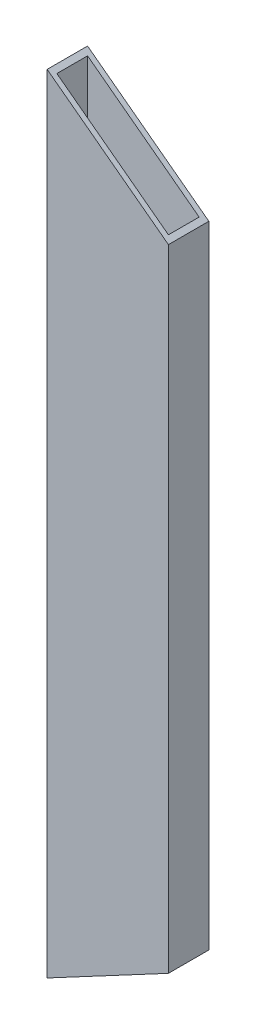
ISO-10303-21;
HEADER;
FILE_DESCRIPTION(('STEP AP214'),'2;1');
FILE_NAME('part.step','',(''),(''),'','','');
FILE_SCHEMA(('AUTOMOTIVE_DESIGN { 1 0 10303 214 1 1 1 1 }'));
ENDSEC;
DATA;
#1=APPLICATION_CONTEXT('core data for automotive mechanical design processes');
#2=APPLICATION_PROTOCOL_DEFINITION('international standard','automotive_design',2000,#1);
#3=PRODUCT_CONTEXT('',#1,'mechanical');
#4=PRODUCT('Part','Part','',(#3));
#5=PRODUCT_RELATED_PRODUCT_CATEGORY('part','',(#4));
#6=PRODUCT_DEFINITION_FORMATION('','',#4);
#7=PRODUCT_DEFINITION_CONTEXT('part definition',#1,'design');
#8=PRODUCT_DEFINITION('design','',#6,#7);
#9=PRODUCT_DEFINITION_SHAPE('','',#8);
#10=(LENGTH_UNIT() NAMED_UNIT(*) SI_UNIT(.MILLI.,.METRE.));
#11=(NAMED_UNIT(*) PLANE_ANGLE_UNIT() SI_UNIT($,.RADIAN.));
#12=(NAMED_UNIT(*) SI_UNIT($,.STERADIAN.) SOLID_ANGLE_UNIT());
#13=UNCERTAINTY_MEASURE_WITH_UNIT(LENGTH_MEASURE(1.E-05),#10,'distance_accuracy_value','');
#14=(GEOMETRIC_REPRESENTATION_CONTEXT(3) GLOBAL_UNCERTAINTY_ASSIGNED_CONTEXT((#13)) GLOBAL_UNIT_ASSIGNED_CONTEXT((#10,
#11,#12)) REPRESENTATION_CONTEXT('',''));
#15=CARTESIAN_POINT('',(0.,0.,0.));
#16=DIRECTION('',(0.,0.,1.));
#17=DIRECTION('',(1.,0.,0.));
#18=AXIS2_PLACEMENT_3D('',#15,#16,#17);
#19=CARTESIAN_POINT('',(-38.1,536.341159245056,-12.7));
#20=DIRECTION('',(1.,0.,0.));
#21=DIRECTION('',(0.,0.,-1.));
#22=AXIS2_PLACEMENT_3D('',#19,#20,#21);
#23=PLANE('',#22);
#24=DIRECTION('',(0.,-1.,0.));
#25=VECTOR('',#24,1.);
#26=CARTESIAN_POINT('',(-38.1,536.341159245056,-12.7));
#27=LINE('',#26,#25);
#28=CARTESIAN_POINT('',(-38.0999999999999,517.316735070927,-12.7));
#29=VERTEX_POINT('',#28);
#30=CARTESIAN_POINT('',(-38.1,22.8617814721547,-12.7));
#31=VERTEX_POINT('',#30);
#32=EDGE_CURVE('E113',#29,#31,#27,.T.);
#33=ORIENTED_EDGE('',*,*,#32,.T.);
#34=DIRECTION('',(0.,0.,1.));
#35=VECTOR('',#34,1.);
#36=CARTESIAN_POINT('',(-38.1,22.8617814721547,-12.6999999999999));
#37=LINE('',#36,#35);
#38=CARTESIAN_POINT('',(-38.1,22.8617814721547,12.7));
#39=VERTEX_POINT('',#38);
#40=EDGE_CURVE('E50',#31,#39,#37,.T.);
#41=ORIENTED_EDGE('',*,*,#40,.T.);
#42=DIRECTION('',(0.,-1.,0.));
#43=VECTOR('',#42,1.);
#44=CARTESIAN_POINT('',(-38.1,536.341159245056,12.7));
#45=LINE('',#44,#43);
#46=CARTESIAN_POINT('',(-38.0999999999999,517.316735070927,12.7));
#47=VERTEX_POINT('',#46);
#48=EDGE_CURVE('E111',#47,#39,#45,.T.);
#49=ORIENTED_EDGE('',*,*,#48,.F.);
#50=DIRECTION('',(0.,0.,-1.));
#51=VECTOR('',#50,1.);
#52=CARTESIAN_POINT('',(-38.1,517.316735070927,-12.7));
#53=LINE('',#52,#51);
#54=EDGE_CURVE('E138',#47,#29,#53,.T.);
#55=ORIENTED_EDGE('',*,*,#54,.T.);
#56=EDGE_LOOP('',(#33,#41,#49,#55));
#57=FACE_BOUND('',#56,.T.);
#58=ADVANCED_FACE('F36',(#57),#23,.F.);
#59=CARTESIAN_POINT('',(-38.1,536.341159245056,12.7));
#60=DIRECTION('',(0.,0.,-1.));
#61=DIRECTION('',(-1.,0.,0.));
#62=AXIS2_PLACEMENT_3D('',#59,#60,#61);
#63=PLANE('',#62);
#64=ORIENTED_EDGE('',*,*,#48,.T.);
#65=DIRECTION('',(0.882385296761728,0.470527563548318,0.));
#66=VECTOR('',#65,1.);
#67=CARTESIAN_POINT('',(-87.3188564866453,-3.383928546231,12.7));
#68=LINE('',#67,#66);
#69=CARTESIAN_POINT('',(38.1,63.4950518518442,12.7));
#70=VERTEX_POINT('',#69);
#71=EDGE_CURVE('E97',#39,#70,#68,.T.);
#72=ORIENTED_EDGE('',*,*,#71,.T.);
#73=DIRECTION('',(0.,-1.,0.));
#74=VECTOR('',#73,1.);
#75=CARTESIAN_POINT('',(38.1,536.341159245056,12.7));
#76=LINE('',#75,#74);
#77=CARTESIAN_POINT('',(38.1,460.038718408292,12.7));
#78=VERTEX_POINT('',#77);
#79=EDGE_CURVE('E118',#78,#70,#76,.T.);
#80=ORIENTED_EDGE('',*,*,#79,.F.);
#81=DIRECTION('',(0.799354935162214,-0.600859124613925,0.));
#82=VECTOR('',#81,1.);
#83=CARTESIAN_POINT('',(-147.887614777533,599.841890301616,12.7));
#84=LINE('',#83,#82);
#85=EDGE_CURVE('E114',#47,#78,#84,.T.);
#86=ORIENTED_EDGE('',*,*,#85,.F.);
#87=EDGE_LOOP('',(#64,#72,#80,#86));
#88=FACE_BOUND('',#87,.T.);
#89=ADVANCED_FACE('F117',(#88),#63,.F.);
#90=CARTESIAN_POINT('',(38.1,536.341159245056,-12.7));
#91=DIRECTION('',(-1.,0.,0.));
#92=DIRECTION('',(0.,0.,1.));
#93=AXIS2_PLACEMENT_3D('',#90,#91,#92);
#94=PLANE('',#93);
#95=ORIENTED_EDGE('',*,*,#79,.T.);
#96=DIRECTION('',(0.,0.,-1.));
#97=VECTOR('',#96,1.);
#98=CARTESIAN_POINT('',(38.1,63.4950518518442,-12.6999999999999));
#99=LINE('',#98,#97);
#100=CARTESIAN_POINT('',(38.1,63.4950518518442,-12.7));
#101=VERTEX_POINT('',#100);
#102=EDGE_CURVE('E100',#70,#101,#99,.T.);
#103=ORIENTED_EDGE('',*,*,#102,.T.);
#104=DIRECTION('',(0.,-1.,0.));
#105=VECTOR('',#104,1.);
#106=CARTESIAN_POINT('',(38.1,536.341159245056,-12.7));
#107=LINE('',#106,#105);
#108=CARTESIAN_POINT('',(38.1,460.038718408292,-12.7));
#109=VERTEX_POINT('',#108);
#110=EDGE_CURVE('E120',#109,#101,#107,.T.);
#111=ORIENTED_EDGE('',*,*,#110,.F.);
#112=DIRECTION('',(0.,0.,1.));
#113=VECTOR('',#112,1.);
#114=CARTESIAN_POINT('',(38.1,460.038718408292,-12.7));
#115=LINE('',#114,#113);
#116=EDGE_CURVE('E140',#109,#78,#115,.T.);
#117=ORIENTED_EDGE('',*,*,#116,.T.);
#118=EDGE_LOOP('',(#95,#103,#111,#117));
#119=FACE_BOUND('',#118,.T.);
#120=ADVANCED_FACE('F162',(#119),#94,.F.);
#121=CARTESIAN_POINT('',(-38.1,536.341159245056,-12.7));
#122=DIRECTION('',(0.,0.,1.));
#123=DIRECTION('',(1.,0.,0.));
#124=AXIS2_PLACEMENT_3D('',#121,#122,#123);
#125=PLANE('',#124);
#126=ORIENTED_EDGE('',*,*,#110,.T.);
#127=DIRECTION('',(0.882385296761728,0.470527563548318,0.));
#128=VECTOR('',#127,1.);
#129=CARTESIAN_POINT('',(-87.3188564866453,-3.38392854623101,-12.7));
#130=LINE('',#129,#128);
#131=EDGE_CURVE('E105',#31,#101,#130,.T.);
#132=ORIENTED_EDGE('',*,*,#131,.F.);
#133=ORIENTED_EDGE('',*,*,#32,.F.);
#134=DIRECTION('',(0.799354935162214,-0.600859124613925,0.));
#135=VECTOR('',#134,1.);
#136=CARTESIAN_POINT('',(-147.887614777533,599.841890301616,-12.7));
#137=LINE('',#136,#135);
#138=EDGE_CURVE('E149',#29,#109,#137,.T.);
#139=ORIENTED_EDGE('',*,*,#138,.T.);
#140=EDGE_LOOP('',(#126,#132,#133,#139));
#141=FACE_BOUND('',#140,.T.);
#142=ADVANCED_FACE('F163',(#141),#125,.F.);
#143=CARTESIAN_POINT('',(-35.052,536.341159245056,-9.65199999999999));
#144=DIRECTION('',(1.,0.,0.));
#145=DIRECTION('',(0.,0.,-1.));
#146=AXIS2_PLACEMENT_3D('',#143,#144,#145);
#147=PLANE('',#146);
#148=DIRECTION('',(0.,0.,1.));
#149=VECTOR('',#148,1.);
#150=CARTESIAN_POINT('',(-35.052,24.4871122873422,-9.65199999999981));
#151=LINE('',#150,#149);
#152=CARTESIAN_POINT('',(-35.052,24.4871122873423,-9.65199999999999));
#153=VERTEX_POINT('',#152);
#154=CARTESIAN_POINT('',(-35.052,24.4871122873423,9.652));
#155=VERTEX_POINT('',#154);
#156=EDGE_CURVE('E154',#153,#155,#151,.T.);
#157=ORIENTED_EDGE('',*,*,#156,.F.);
#158=DIRECTION('',(0.,-1.,0.));
#159=VECTOR('',#158,1.);
#160=CARTESIAN_POINT('',(-35.052,536.341159245056,-9.65199999999999));
#161=LINE('',#160,#159);
#162=CARTESIAN_POINT('',(-35.052,515.025614404422,-9.65199999999999));
#163=VERTEX_POINT('',#162);
#164=EDGE_CURVE('E135',#163,#153,#161,.T.);
#165=ORIENTED_EDGE('',*,*,#164,.F.);
#166=DIRECTION('',(0.,0.,-1.));
#167=VECTOR('',#166,1.);
#168=CARTESIAN_POINT('',(-35.052,515.025614404422,-9.65199999999999));
#169=LINE('',#168,#167);
#170=CARTESIAN_POINT('',(-35.052,515.025614404422,9.652));
#171=VERTEX_POINT('',#170);
#172=EDGE_CURVE('E143',#171,#163,#169,.T.);
#173=ORIENTED_EDGE('',*,*,#172,.F.);
#174=DIRECTION('',(0.,-1.,0.));
#175=VECTOR('',#174,1.);
#176=CARTESIAN_POINT('',(-35.052,536.341159245056,9.652));
#177=LINE('',#176,#175);
#178=EDGE_CURVE('E126',#171,#155,#177,.T.);
#179=ORIENTED_EDGE('',*,*,#178,.T.);
#180=EDGE_LOOP('',(#157,#165,#173,#179));
#181=FACE_BOUND('',#180,.T.);
#182=ADVANCED_FACE('F189',(#181),#147,.T.);
#183=CARTESIAN_POINT('',(-35.052,536.341159245056,9.652));
#184=DIRECTION('',(0.,0.,-1.));
#185=DIRECTION('',(-1.,0.,0.));
#186=AXIS2_PLACEMENT_3D('',#183,#184,#185);
#187=PLANE('',#186);
#188=DIRECTION('',(0.882385296761728,0.470527563548318,0.));
#189=VECTOR('',#188,1.);
#190=CARTESIAN_POINT('',(177.462943395691,137.809647126208,9.65199999999997));
#191=LINE('',#190,#189);
#192=CARTESIAN_POINT('',(35.052,61.8697210366567,9.65199999999999));
#193=VERTEX_POINT('',#192);
#194=EDGE_CURVE('E156',#155,#193,#191,.T.);
#195=ORIENTED_EDGE('',*,*,#194,.F.);
#196=ORIENTED_EDGE('',*,*,#178,.F.);
#197=DIRECTION('',(-0.799354935162214,0.600859124613925,0.));
#198=VECTOR('',#197,1.);
#199=CARTESIAN_POINT('',(-45.2898499329202,522.721201531028,9.652));
#200=LINE('',#199,#198);
#201=CARTESIAN_POINT('',(35.052,462.329839074797,9.65199999999999));
#202=VERTEX_POINT('',#201);
#203=EDGE_CURVE('E145',#202,#171,#200,.T.);
#204=ORIENTED_EDGE('',*,*,#203,.F.);
#205=DIRECTION('',(0.,-1.,0.));
#206=VECTOR('',#205,1.);
#207=CARTESIAN_POINT('',(35.052,536.341159245056,9.65199999999999));
#208=LINE('',#207,#206);
#209=EDGE_CURVE('E129',#202,#193,#208,.T.);
#210=ORIENTED_EDGE('',*,*,#209,.T.);
#211=EDGE_LOOP('',(#195,#196,#204,#210));
#212=FACE_BOUND('',#211,.T.);
#213=ADVANCED_FACE('F192',(#212),#187,.T.);
#214=CARTESIAN_POINT('',(35.052,536.341159245056,-9.652));
#215=DIRECTION('',(-1.,0.,0.));
#216=DIRECTION('',(0.,0.,1.));
#217=AXIS2_PLACEMENT_3D('',#214,#215,#216);
#218=PLANE('',#217);
#219=DIRECTION('',(0.,0.,-1.));
#220=VECTOR('',#219,1.);
#221=CARTESIAN_POINT('',(35.052,61.8697210366567,-9.65199999999983));
#222=LINE('',#221,#220);
#223=CARTESIAN_POINT('',(35.052,61.8697210366567,-9.652));
#224=VERTEX_POINT('',#223);
#225=EDGE_CURVE('E57',#193,#224,#222,.T.);
#226=ORIENTED_EDGE('',*,*,#225,.F.);
#227=ORIENTED_EDGE('',*,*,#209,.F.);
#228=DIRECTION('',(0.,0.,1.));
#229=VECTOR('',#228,1.);
#230=CARTESIAN_POINT('',(35.052,462.329839074797,-9.652));
#231=LINE('',#230,#229);
#232=CARTESIAN_POINT('',(35.052,462.329839074797,-9.652));
#233=VERTEX_POINT('',#232);
#234=EDGE_CURVE('E147',#233,#202,#231,.T.);
#235=ORIENTED_EDGE('',*,*,#234,.F.);
#236=DIRECTION('',(0.,-1.,0.));
#237=VECTOR('',#236,1.);
#238=CARTESIAN_POINT('',(35.052,536.341159245056,-9.652));
#239=LINE('',#238,#237);
#240=EDGE_CURVE('E132',#233,#224,#239,.T.);
#241=ORIENTED_EDGE('',*,*,#240,.T.);
#242=EDGE_LOOP('',(#226,#227,#235,#241));
#243=FACE_BOUND('',#242,.T.);
#244=ADVANCED_FACE('F175',(#243),#218,.T.);
#245=CARTESIAN_POINT('',(-35.052,536.341159245056,-9.65199999999999));
#246=DIRECTION('',(0.,0.,1.));
#247=DIRECTION('',(1.,0.,0.));
#248=AXIS2_PLACEMENT_3D('',#245,#246,#247);
#249=PLANE('',#248);
#250=DIRECTION('',(-0.882385296761728,-0.470527563548318,0.));
#251=VECTOR('',#250,1.);
#252=CARTESIAN_POINT('',(177.462943395691,137.809647126208,-9.65200000000002));
#253=LINE('',#252,#251);
#254=EDGE_CURVE('E11',#224,#153,#253,.T.);
#255=ORIENTED_EDGE('',*,*,#254,.F.);
#256=ORIENTED_EDGE('',*,*,#240,.F.);
#257=DIRECTION('',(0.799354935162214,-0.600859124613925,0.));
#258=VECTOR('',#257,1.);
#259=CARTESIAN_POINT('',(-45.2898499329202,522.721201531028,-9.65199999999999));
#260=LINE('',#259,#258);
#261=EDGE_CURVE('E43',#163,#233,#260,.T.);
#262=ORIENTED_EDGE('',*,*,#261,.F.);
#263=ORIENTED_EDGE('',*,*,#164,.T.);
#264=EDGE_LOOP('',(#255,#256,#262,#263));
#265=FACE_BOUND('',#264,.T.);
#266=ADVANCED_FACE('F167',(#265),#249,.T.);
#267=CARTESIAN_POINT('',(-147.887614777533,599.841890301616,-12.7));
#268=DIRECTION('',(-0.600859124613925,-0.799354935162214,0.));
#269=DIRECTION('',(0.799354935162214,-0.600859124613925,0.));
#270=AXIS2_PLACEMENT_3D('',#267,#268,#269);
#271=PLANE('',#270);
#272=ORIENTED_EDGE('',*,*,#172,.T.);
#273=ORIENTED_EDGE('',*,*,#261,.T.);
#274=ORIENTED_EDGE('',*,*,#234,.T.);
#275=ORIENTED_EDGE('',*,*,#203,.T.);
#276=EDGE_LOOP('',(#272,#273,#274,#275));
#277=FACE_BOUND('',#276,.T.);
#278=ORIENTED_EDGE('',*,*,#85,.T.);
#279=ORIENTED_EDGE('',*,*,#116,.F.);
#280=ORIENTED_EDGE('',*,*,#138,.F.);
#281=ORIENTED_EDGE('',*,*,#54,.F.);
#282=EDGE_LOOP('',(#278,#279,#280,#281));
#283=FACE_BOUND('',#282,.T.);
#284=ADVANCED_FACE('F165',(#277,#283),#271,.F.);
#285=CARTESIAN_POINT('',(-87.3188564866453,-3.383928546231,12.7));
#286=DIRECTION('',(-0.470527563548318,0.882385296761728,0.));
#287=DIRECTION('',(-0.882385296761728,-0.470527563548318,0.));
#288=AXIS2_PLACEMENT_3D('',#285,#286,#287);
#289=PLANE('',#288);
#290=ORIENTED_EDGE('',*,*,#156,.T.);
#291=ORIENTED_EDGE('',*,*,#194,.T.);
#292=ORIENTED_EDGE('',*,*,#225,.T.);
#293=ORIENTED_EDGE('',*,*,#254,.T.);
#294=EDGE_LOOP('',(#290,#291,#292,#293));
#295=FACE_BOUND('',#294,.T.);
#296=ORIENTED_EDGE('',*,*,#131,.T.);
#297=ORIENTED_EDGE('',*,*,#102,.F.);
#298=ORIENTED_EDGE('',*,*,#71,.F.);
#299=ORIENTED_EDGE('',*,*,#40,.F.);
#300=EDGE_LOOP('',(#296,#297,#298,#299));
#301=FACE_BOUND('',#300,.T.);
#302=ADVANCED_FACE('F98',(#295,#301),#289,.F.);
#303=CLOSED_SHELL('',(#58,#89,#120,#142,#182,#213,#244,#266,#284,#302));
#304=MANIFOLD_SOLID_BREP('B2',#303);
#305=ADVANCED_BREP_SHAPE_REPRESENTATION('',(#18,#304),#14);
#306=SHAPE_DEFINITION_REPRESENTATION(#9,#305);
ENDSEC;
END-ISO-10303-21;
